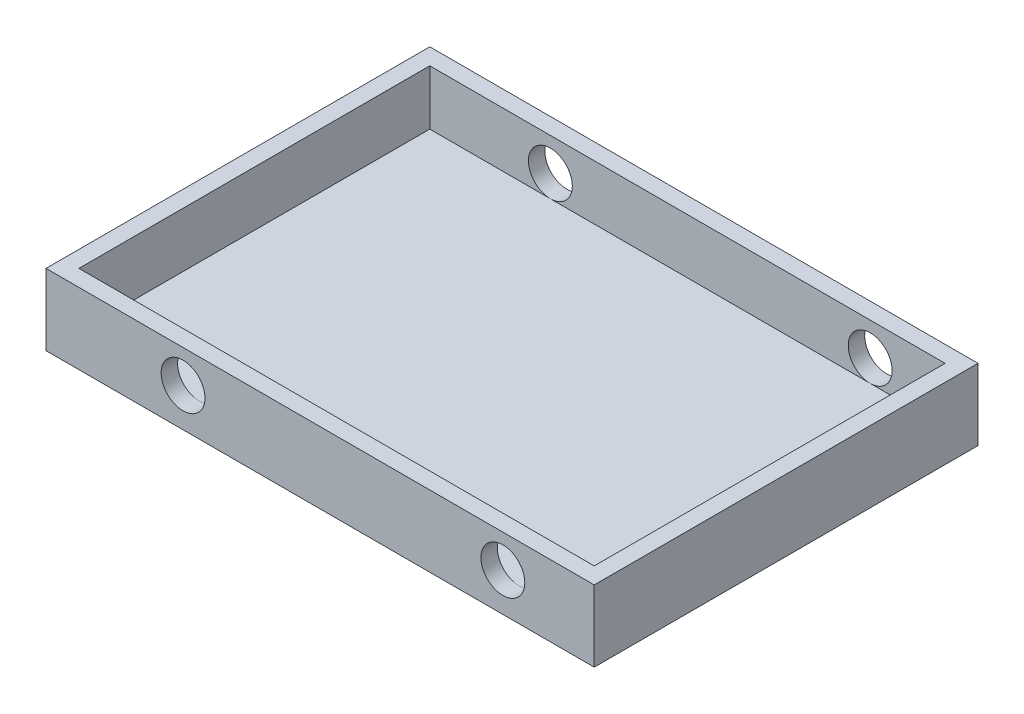
ISO-10303-21;
HEADER;
FILE_DESCRIPTION(('STEP AP214'),'2;1');
FILE_NAME('part.step','',(''),(''),'','','');
FILE_SCHEMA(('AUTOMOTIVE_DESIGN { 1 0 10303 214 1 1 1 1 }'));
ENDSEC;
DATA;
#1=APPLICATION_CONTEXT('core data for automotive mechanical design processes');
#2=APPLICATION_PROTOCOL_DEFINITION('international standard','automotive_design',2000,#1);
#3=PRODUCT_CONTEXT('',#1,'mechanical');
#4=PRODUCT('Part','Part','',(#3));
#5=PRODUCT_RELATED_PRODUCT_CATEGORY('part','',(#4));
#6=PRODUCT_DEFINITION_FORMATION('','',#4);
#7=PRODUCT_DEFINITION_CONTEXT('part definition',#1,'design');
#8=PRODUCT_DEFINITION('design','',#6,#7);
#9=PRODUCT_DEFINITION_SHAPE('','',#8);
#10=(LENGTH_UNIT() NAMED_UNIT(*) SI_UNIT(.MILLI.,.METRE.));
#11=(NAMED_UNIT(*) PLANE_ANGLE_UNIT() SI_UNIT($,.RADIAN.));
#12=(NAMED_UNIT(*) SI_UNIT($,.STERADIAN.) SOLID_ANGLE_UNIT());
#13=UNCERTAINTY_MEASURE_WITH_UNIT(LENGTH_MEASURE(1.E-05),#10,'distance_accuracy_value','');
#14=(GEOMETRIC_REPRESENTATION_CONTEXT(3) GLOBAL_UNCERTAINTY_ASSIGNED_CONTEXT((#13)) GLOBAL_UNIT_ASSIGNED_CONTEXT((#10,
#11,#12)) REPRESENTATION_CONTEXT('',''));
#15=CARTESIAN_POINT('',(0.,0.,0.));
#16=DIRECTION('',(0.,0.,1.));
#17=DIRECTION('',(1.,0.,0.));
#18=AXIS2_PLACEMENT_3D('',#15,#16,#17);
#19=CARTESIAN_POINT('',(250.,15.,-175.));
#20=DIRECTION('',(-1.,0.,0.));
#21=DIRECTION('',(0.,0.,1.));
#22=AXIS2_PLACEMENT_3D('',#19,#20,#21);
#23=PLANE('',#22);
#24=DIRECTION('',(0.,0.,-1.));
#25=VECTOR('',#24,1.);
#26=CARTESIAN_POINT('',(250.,0.,-175.));
#27=LINE('',#26,#25);
#28=CARTESIAN_POINT('',(250.,0.,175.));
#29=VERTEX_POINT('',#28);
#30=CARTESIAN_POINT('',(250.,0.,-175.));
#31=VERTEX_POINT('',#30);
#32=EDGE_CURVE('E177',#29,#31,#27,.T.);
#33=ORIENTED_EDGE('',*,*,#32,.T.);
#34=DIRECTION('',(0.,-1.,0.));
#35=VECTOR('',#34,1.);
#36=CARTESIAN_POINT('',(250.,15.,-175.));
#37=LINE('',#36,#35);
#38=CARTESIAN_POINT('',(250.,65.,-175.));
#39=VERTEX_POINT('',#38);
#40=EDGE_CURVE('E11',#39,#31,#37,.T.);
#41=ORIENTED_EDGE('',*,*,#40,.F.);
#42=DIRECTION('',(0.,0.,-1.));
#43=VECTOR('',#42,1.);
#44=CARTESIAN_POINT('',(250.,65.,-175.));
#45=LINE('',#44,#43);
#46=CARTESIAN_POINT('',(250.,65.,175.));
#47=VERTEX_POINT('',#46);
#48=EDGE_CURVE('E136',#47,#39,#45,.T.);
#49=ORIENTED_EDGE('',*,*,#48,.F.);
#50=DIRECTION('',(0.,-1.,0.));
#51=VECTOR('',#50,1.);
#52=CARTESIAN_POINT('',(250.,15.,175.));
#53=LINE('',#52,#51);
#54=EDGE_CURVE('E186',#47,#29,#53,.T.);
#55=ORIENTED_EDGE('',*,*,#54,.T.);
#56=EDGE_LOOP('',(#33,#41,#49,#55));
#57=FACE_BOUND('',#56,.T.);
#58=ADVANCED_FACE('F39',(#57),#23,.F.);
#59=CARTESIAN_POINT('',(-250.,15.,-175.));
#60=DIRECTION('',(0.,0.,1.));
#61=DIRECTION('',(1.,0.,0.));
#62=AXIS2_PLACEMENT_3D('',#59,#60,#61);
#63=PLANE('',#62);
#64=CARTESIAN_POINT('',(166.666666666667,35.,-175.));
#65=DIRECTION('',(0.,0.,1.));
#66=DIRECTION('',(1.,0.,0.));
#67=AXIS2_PLACEMENT_3D('',#64,#65,#66);
#68=CIRCLE('',#67,20.);
#69=CARTESIAN_POINT('',(186.666666666667,35.,-175.));
#70=VERTEX_POINT('',#69);
#71=EDGE_CURVE('E263',#70,#70,#68,.T.);
#72=ORIENTED_EDGE('',*,*,#71,.T.);
#73=EDGE_LOOP('',(#72));
#74=FACE_BOUND('',#73,.T.);
#75=CARTESIAN_POINT('',(-125.,35.,-175.));
#76=DIRECTION('',(0.,0.,1.));
#77=DIRECTION('',(1.,0.,0.));
#78=AXIS2_PLACEMENT_3D('',#75,#76,#77);
#79=CIRCLE('',#78,20.);
#80=CARTESIAN_POINT('',(-105.,35.,-175.));
#81=VERTEX_POINT('',#80);
#82=EDGE_CURVE('E268',#81,#81,#79,.T.);
#83=ORIENTED_EDGE('',*,*,#82,.T.);
#84=EDGE_LOOP('',(#83));
#85=FACE_BOUND('',#84,.T.);
#86=DIRECTION('',(-1.,0.,0.));
#87=VECTOR('',#86,1.);
#88=CARTESIAN_POINT('',(-250.,0.,-175.));
#89=LINE('',#88,#87);
#90=CARTESIAN_POINT('',(-250.,0.,-175.));
#91=VERTEX_POINT('',#90);
#92=EDGE_CURVE('E180',#31,#91,#89,.T.);
#93=ORIENTED_EDGE('',*,*,#92,.T.);
#94=DIRECTION('',(0.,-1.,0.));
#95=VECTOR('',#94,1.);
#96=CARTESIAN_POINT('',(-250.,15.,-175.));
#97=LINE('',#96,#95);
#98=CARTESIAN_POINT('',(-250.,65.,-175.));
#99=VERTEX_POINT('',#98);
#100=EDGE_CURVE('E46',#99,#91,#97,.T.);
#101=ORIENTED_EDGE('',*,*,#100,.F.);
#102=DIRECTION('',(-1.,0.,0.));
#103=VECTOR('',#102,1.);
#104=CARTESIAN_POINT('',(-250.,65.,-175.));
#105=LINE('',#104,#103);
#106=EDGE_CURVE('E168',#39,#99,#105,.T.);
#107=ORIENTED_EDGE('',*,*,#106,.F.);
#108=ORIENTED_EDGE('',*,*,#40,.T.);
#109=EDGE_LOOP('',(#93,#101,#107,#108));
#110=FACE_BOUND('',#109,.T.);
#111=ADVANCED_FACE('F208',(#74,#85,#110),#63,.F.);
#112=CARTESIAN_POINT('',(-250.,15.,-175.));
#113=DIRECTION('',(1.,0.,0.));
#114=DIRECTION('',(0.,0.,-1.));
#115=AXIS2_PLACEMENT_3D('',#112,#113,#114);
#116=PLANE('',#115);
#117=DIRECTION('',(0.,0.,1.));
#118=VECTOR('',#117,1.);
#119=CARTESIAN_POINT('',(-250.,0.,-175.));
#120=LINE('',#119,#118);
#121=CARTESIAN_POINT('',(-250.,0.,175.));
#122=VERTEX_POINT('',#121);
#123=EDGE_CURVE('E182',#91,#122,#120,.T.);
#124=ORIENTED_EDGE('',*,*,#123,.T.);
#125=DIRECTION('',(0.,-1.,0.));
#126=VECTOR('',#125,1.);
#127=CARTESIAN_POINT('',(-250.,15.,175.));
#128=LINE('',#127,#126);
#129=CARTESIAN_POINT('',(-250.,65.,175.));
#130=VERTEX_POINT('',#129);
#131=EDGE_CURVE('E189',#130,#122,#128,.T.);
#132=ORIENTED_EDGE('',*,*,#131,.F.);
#133=DIRECTION('',(0.,0.,1.));
#134=VECTOR('',#133,1.);
#135=CARTESIAN_POINT('',(-250.,65.,-175.));
#136=LINE('',#135,#134);
#137=EDGE_CURVE('E171',#99,#130,#136,.T.);
#138=ORIENTED_EDGE('',*,*,#137,.F.);
#139=ORIENTED_EDGE('',*,*,#100,.T.);
#140=EDGE_LOOP('',(#124,#132,#138,#139));
#141=FACE_BOUND('',#140,.T.);
#142=ADVANCED_FACE('F195',(#141),#116,.F.);
#143=CARTESIAN_POINT('',(-250.,15.,175.));
#144=DIRECTION('',(0.,0.,-1.));
#145=DIRECTION('',(-1.,0.,0.));
#146=AXIS2_PLACEMENT_3D('',#143,#144,#145);
#147=PLANE('',#146);
#148=CARTESIAN_POINT('',(166.666666666667,35.,175.));
#149=DIRECTION('',(0.,0.,1.));
#150=DIRECTION('',(1.,0.,0.));
#151=AXIS2_PLACEMENT_3D('',#148,#149,#150);
#152=CIRCLE('',#151,20.);
#153=CARTESIAN_POINT('',(186.666666666667,35.,175.));
#154=VERTEX_POINT('',#153);
#155=EDGE_CURVE('E262',#154,#154,#152,.T.);
#156=ORIENTED_EDGE('',*,*,#155,.F.);
#157=EDGE_LOOP('',(#156));
#158=FACE_BOUND('',#157,.T.);
#159=CARTESIAN_POINT('',(-125.,35.,175.));
#160=DIRECTION('',(0.,0.,1.));
#161=DIRECTION('',(1.,0.,0.));
#162=AXIS2_PLACEMENT_3D('',#159,#160,#161);
#163=CIRCLE('',#162,20.);
#164=CARTESIAN_POINT('',(-105.,35.,175.));
#165=VERTEX_POINT('',#164);
#166=EDGE_CURVE('E264',#165,#165,#163,.T.);
#167=ORIENTED_EDGE('',*,*,#166,.F.);
#168=EDGE_LOOP('',(#167));
#169=FACE_BOUND('',#168,.T.);
#170=DIRECTION('',(1.,0.,0.));
#171=VECTOR('',#170,1.);
#172=CARTESIAN_POINT('',(-250.,0.,175.));
#173=LINE('',#172,#171);
#174=EDGE_CURVE('E184',#122,#29,#173,.T.);
#175=ORIENTED_EDGE('',*,*,#174,.T.);
#176=ORIENTED_EDGE('',*,*,#54,.F.);
#177=DIRECTION('',(1.,0.,0.));
#178=VECTOR('',#177,1.);
#179=CARTESIAN_POINT('',(-250.,65.,175.));
#180=LINE('',#179,#178);
#181=EDGE_CURVE('E174',#130,#47,#180,.T.);
#182=ORIENTED_EDGE('',*,*,#181,.F.);
#183=ORIENTED_EDGE('',*,*,#131,.T.);
#184=EDGE_LOOP('',(#175,#176,#182,#183));
#185=FACE_BOUND('',#184,.T.);
#186=ADVANCED_FACE('F203',(#158,#169,#185),#147,.F.);
#187=CARTESIAN_POINT('',(0.,0.,0.));
#188=DIRECTION('',(0.,1.,0.));
#189=DIRECTION('',(0.,0.,1.));
#190=AXIS2_PLACEMENT_3D('',#187,#188,#189);
#191=PLANE('',#190);
#192=ORIENTED_EDGE('',*,*,#32,.F.);
#193=ORIENTED_EDGE('',*,*,#174,.F.);
#194=ORIENTED_EDGE('',*,*,#123,.F.);
#195=ORIENTED_EDGE('',*,*,#92,.F.);
#196=EDGE_LOOP('',(#192,#193,#194,#195));
#197=FACE_BOUND('',#196,.T.);
#198=ADVANCED_FACE('F201',(#197),#191,.F.);
#199=CARTESIAN_POINT('',(0.,65.,0.));
#200=DIRECTION('',(0.,1.,0.));
#201=DIRECTION('',(0.,0.,1.));
#202=AXIS2_PLACEMENT_3D('',#199,#200,#201);
#203=PLANE('',#202);
#204=ORIENTED_EDGE('',*,*,#48,.T.);
#205=ORIENTED_EDGE('',*,*,#106,.T.);
#206=ORIENTED_EDGE('',*,*,#137,.T.);
#207=ORIENTED_EDGE('',*,*,#181,.T.);
#208=EDGE_LOOP('',(#204,#205,#206,#207));
#209=FACE_BOUND('',#208,.T.);
#210=DIRECTION('',(1.,0.,0.));
#211=VECTOR('',#210,1.);
#212=CARTESIAN_POINT('',(235.,65.,160.));
#213=LINE('',#212,#211);
#214=CARTESIAN_POINT('',(-235.,65.,160.));
#215=VERTEX_POINT('',#214);
#216=CARTESIAN_POINT('',(235.,65.,160.));
#217=VERTEX_POINT('',#216);
#218=EDGE_CURVE('E124',#215,#217,#213,.T.);
#219=ORIENTED_EDGE('',*,*,#218,.F.);
#220=DIRECTION('',(0.,0.,1.));
#221=VECTOR('',#220,1.);
#222=CARTESIAN_POINT('',(-235.,65.,160.));
#223=LINE('',#222,#221);
#224=CARTESIAN_POINT('',(-235.,65.,-160.));
#225=VERTEX_POINT('',#224);
#226=EDGE_CURVE('E114',#225,#215,#223,.T.);
#227=ORIENTED_EDGE('',*,*,#226,.F.);
#228=DIRECTION('',(-1.,0.,0.));
#229=VECTOR('',#228,1.);
#230=CARTESIAN_POINT('',(-235.,65.,-160.));
#231=LINE('',#230,#229);
#232=CARTESIAN_POINT('',(235.,65.,-160.));
#233=VERTEX_POINT('',#232);
#234=EDGE_CURVE('E144',#233,#225,#231,.T.);
#235=ORIENTED_EDGE('',*,*,#234,.F.);
#236=DIRECTION('',(0.,0.,-1.));
#237=VECTOR('',#236,1.);
#238=CARTESIAN_POINT('',(235.,65.,-160.));
#239=LINE('',#238,#237);
#240=EDGE_CURVE('E142',#217,#233,#239,.T.);
#241=ORIENTED_EDGE('',*,*,#240,.F.);
#242=EDGE_LOOP('',(#219,#227,#235,#241));
#243=FACE_BOUND('',#242,.T.);
#244=ADVANCED_FACE('F140',(#209,#243),#203,.T.);
#245=CARTESIAN_POINT('',(-235.,65.,160.));
#246=DIRECTION('',(1.,0.,0.));
#247=DIRECTION('',(0.,0.,-1.));
#248=AXIS2_PLACEMENT_3D('',#245,#246,#247);
#249=PLANE('',#248);
#250=DIRECTION('',(0.,0.,1.));
#251=VECTOR('',#250,1.);
#252=CARTESIAN_POINT('',(-235.,15.,160.));
#253=LINE('',#252,#251);
#254=CARTESIAN_POINT('',(-235.,15.,-160.));
#255=VERTEX_POINT('',#254);
#256=CARTESIAN_POINT('',(-235.,15.,160.));
#257=VERTEX_POINT('',#256);
#258=EDGE_CURVE('E149',#255,#257,#253,.T.);
#259=ORIENTED_EDGE('',*,*,#258,.F.);
#260=DIRECTION('',(0.,-1.,0.));
#261=VECTOR('',#260,1.);
#262=CARTESIAN_POINT('',(-235.,65.,-160.));
#263=LINE('',#262,#261);
#264=EDGE_CURVE('E120',#225,#255,#263,.T.);
#265=ORIENTED_EDGE('',*,*,#264,.F.);
#266=ORIENTED_EDGE('',*,*,#226,.T.);
#267=DIRECTION('',(0.,-1.,0.));
#268=VECTOR('',#267,1.);
#269=CARTESIAN_POINT('',(-235.,65.,160.));
#270=LINE('',#269,#268);
#271=EDGE_CURVE('E118',#215,#257,#270,.T.);
#272=ORIENTED_EDGE('',*,*,#271,.T.);
#273=EDGE_LOOP('',(#259,#265,#266,#272));
#274=FACE_BOUND('',#273,.T.);
#275=ADVANCED_FACE('F117',(#274),#249,.T.);
#276=CARTESIAN_POINT('',(235.,65.,160.));
#277=DIRECTION('',(0.,0.,-1.));
#278=DIRECTION('',(-1.,0.,0.));
#279=AXIS2_PLACEMENT_3D('',#276,#277,#278);
#280=PLANE('',#279);
#281=DIRECTION('',(1.,0.,0.));
#282=VECTOR('',#281,1.);
#283=CARTESIAN_POINT('',(235.,15.,160.));
#284=LINE('',#283,#282);
#285=CARTESIAN_POINT('',(166.666666666667,15.,160.));
#286=VERTEX_POINT('',#285);
#287=CARTESIAN_POINT('',(235.,15.,160.));
#288=VERTEX_POINT('',#287);
#289=EDGE_CURVE('E151',#286,#288,#284,.T.);
#290=ORIENTED_EDGE('',*,*,#289,.F.);
#291=CARTESIAN_POINT('',(166.666666666667,35.,160.));
#292=DIRECTION('',(0.,0.,-1.));
#293=DIRECTION('',(-1.,0.,0.));
#294=AXIS2_PLACEMENT_3D('',#291,#292,#293);
#295=CIRCLE('',#294,20.);
#296=EDGE_CURVE('E152',#286,#286,#295,.T.);
#297=ORIENTED_EDGE('',*,*,#296,.F.);
#298=CARTESIAN_POINT('',(-125.,15.,160.));
#299=VERTEX_POINT('',#298);
#300=EDGE_CURVE('E155',#299,#286,#284,.T.);
#301=ORIENTED_EDGE('',*,*,#300,.F.);
#302=CARTESIAN_POINT('',(-125.,35.,160.));
#303=DIRECTION('',(0.,0.,-1.));
#304=DIRECTION('',(-1.,0.,0.));
#305=AXIS2_PLACEMENT_3D('',#302,#303,#304);
#306=CIRCLE('',#305,20.);
#307=EDGE_CURVE('E274',#299,#299,#306,.T.);
#308=ORIENTED_EDGE('',*,*,#307,.F.);
#309=EDGE_CURVE('E135',#257,#299,#284,.T.);
#310=ORIENTED_EDGE('',*,*,#309,.F.);
#311=ORIENTED_EDGE('',*,*,#271,.F.);
#312=ORIENTED_EDGE('',*,*,#218,.T.);
#313=DIRECTION('',(0.,-1.,0.));
#314=VECTOR('',#313,1.);
#315=CARTESIAN_POINT('',(235.,65.,160.));
#316=LINE('',#315,#314);
#317=EDGE_CURVE('E137',#217,#288,#316,.T.);
#318=ORIENTED_EDGE('',*,*,#317,.T.);
#319=EDGE_LOOP('',(#290,#297,#301,#308,#310,#311,#312,#318));
#320=FACE_BOUND('',#319,.T.);
#321=ADVANCED_FACE('F130',(#320),#280,.T.);
#322=CARTESIAN_POINT('',(235.,65.,-160.));
#323=DIRECTION('',(-1.,0.,0.));
#324=DIRECTION('',(0.,0.,1.));
#325=AXIS2_PLACEMENT_3D('',#322,#323,#324);
#326=PLANE('',#325);
#327=DIRECTION('',(0.,0.,-1.));
#328=VECTOR('',#327,1.);
#329=CARTESIAN_POINT('',(235.,15.,-160.));
#330=LINE('',#329,#328);
#331=CARTESIAN_POINT('',(235.,15.,-160.));
#332=VERTEX_POINT('',#331);
#333=EDGE_CURVE('E154',#288,#332,#330,.T.);
#334=ORIENTED_EDGE('',*,*,#333,.F.);
#335=ORIENTED_EDGE('',*,*,#317,.F.);
#336=ORIENTED_EDGE('',*,*,#240,.T.);
#337=DIRECTION('',(0.,-1.,0.));
#338=VECTOR('',#337,1.);
#339=CARTESIAN_POINT('',(235.,65.,-160.));
#340=LINE('',#339,#338);
#341=EDGE_CURVE('E162',#233,#332,#340,.T.);
#342=ORIENTED_EDGE('',*,*,#341,.T.);
#343=EDGE_LOOP('',(#334,#335,#336,#342));
#344=FACE_BOUND('',#343,.T.);
#345=ADVANCED_FACE('F237',(#344),#326,.T.);
#346=CARTESIAN_POINT('',(-235.,65.,-160.));
#347=DIRECTION('',(0.,0.,1.));
#348=DIRECTION('',(1.,0.,0.));
#349=AXIS2_PLACEMENT_3D('',#346,#347,#348);
#350=PLANE('',#349);
#351=DIRECTION('',(-1.,0.,0.));
#352=VECTOR('',#351,1.);
#353=CARTESIAN_POINT('',(-235.,15.,-160.));
#354=LINE('',#353,#352);
#355=CARTESIAN_POINT('',(166.666666666667,15.,-160.));
#356=VERTEX_POINT('',#355);
#357=CARTESIAN_POINT('',(-125.,15.,-160.));
#358=VERTEX_POINT('',#357);
#359=EDGE_CURVE('E160',#356,#358,#354,.T.);
#360=ORIENTED_EDGE('',*,*,#359,.F.);
#361=CARTESIAN_POINT('',(166.666666666667,35.,-160.));
#362=DIRECTION('',(0.,0.,1.));
#363=DIRECTION('',(1.,0.,0.));
#364=AXIS2_PLACEMENT_3D('',#361,#362,#363);
#365=CIRCLE('',#364,20.);
#366=EDGE_CURVE('E56',#356,#356,#365,.T.);
#367=ORIENTED_EDGE('',*,*,#366,.F.);
#368=EDGE_CURVE('E125',#332,#356,#354,.T.);
#369=ORIENTED_EDGE('',*,*,#368,.F.);
#370=ORIENTED_EDGE('',*,*,#341,.F.);
#371=ORIENTED_EDGE('',*,*,#234,.T.);
#372=ORIENTED_EDGE('',*,*,#264,.T.);
#373=EDGE_CURVE('E157',#358,#255,#354,.T.);
#374=ORIENTED_EDGE('',*,*,#373,.F.);
#375=CARTESIAN_POINT('',(-125.,35.,-160.));
#376=DIRECTION('',(0.,0.,1.));
#377=DIRECTION('',(1.,0.,0.));
#378=AXIS2_PLACEMENT_3D('',#375,#376,#377);
#379=CIRCLE('',#378,20.);
#380=EDGE_CURVE('E51',#358,#358,#379,.T.);
#381=ORIENTED_EDGE('',*,*,#380,.F.);
#382=EDGE_LOOP('',(#360,#367,#369,#370,#371,#372,#374,#381));
#383=FACE_BOUND('',#382,.T.);
#384=ADVANCED_FACE('F229',(#383),#350,.T.);
#385=CARTESIAN_POINT('',(0.,15.,0.));
#386=DIRECTION('',(0.,1.,0.));
#387=DIRECTION('',(0.,0.,1.));
#388=AXIS2_PLACEMENT_3D('',#385,#386,#387);
#389=PLANE('',#388);
#390=ORIENTED_EDGE('',*,*,#309,.T.);
#391=ORIENTED_EDGE('',*,*,#300,.T.);
#392=ORIENTED_EDGE('',*,*,#289,.T.);
#393=ORIENTED_EDGE('',*,*,#333,.T.);
#394=ORIENTED_EDGE('',*,*,#368,.T.);
#395=ORIENTED_EDGE('',*,*,#359,.T.);
#396=ORIENTED_EDGE('',*,*,#373,.T.);
#397=ORIENTED_EDGE('',*,*,#258,.T.);
#398=EDGE_LOOP('',(#390,#391,#392,#393,#394,#395,#396,#397));
#399=FACE_BOUND('',#398,.T.);
#400=ADVANCED_FACE('F225',(#399),#389,.T.);
#401=CARTESIAN_POINT('',(-125.,35.,-175.));
#402=DIRECTION('',(0.,0.,1.));
#403=DIRECTION('',(1.,0.,0.));
#404=AXIS2_PLACEMENT_3D('',#401,#402,#403);
#405=CYLINDRICAL_SURFACE('',#404,20.);
#406=ORIENTED_EDGE('',*,*,#380,.T.);
#407=EDGE_LOOP('',(#406));
#408=FACE_BOUND('',#407,.T.);
#409=ORIENTED_EDGE('',*,*,#82,.F.);
#410=EDGE_LOOP('',(#409));
#411=FACE_BOUND('',#410,.T.);
#412=ADVANCED_FACE('F228',(#408,#411),#405,.F.);
#413=CARTESIAN_POINT('',(166.666666666667,35.,-175.));
#414=DIRECTION('',(0.,0.,1.));
#415=DIRECTION('',(1.,0.,0.));
#416=AXIS2_PLACEMENT_3D('',#413,#414,#415);
#417=CYLINDRICAL_SURFACE('',#416,20.);
#418=ORIENTED_EDGE('',*,*,#366,.T.);
#419=EDGE_LOOP('',(#418));
#420=FACE_BOUND('',#419,.T.);
#421=ORIENTED_EDGE('',*,*,#71,.F.);
#422=EDGE_LOOP('',(#421));
#423=FACE_BOUND('',#422,.T.);
#424=ADVANCED_FACE('F245',(#420,#423),#417,.F.);
#425=ORIENTED_EDGE('',*,*,#307,.T.);
#426=EDGE_LOOP('',(#425));
#427=FACE_BOUND('',#426,.T.);
#428=ORIENTED_EDGE('',*,*,#166,.T.);
#429=EDGE_LOOP('',(#428));
#430=FACE_BOUND('',#429,.T.);
#431=ADVANCED_FACE('F246',(#427,#430),#405,.F.);
#432=ORIENTED_EDGE('',*,*,#296,.T.);
#433=EDGE_LOOP('',(#432));
#434=FACE_BOUND('',#433,.T.);
#435=ORIENTED_EDGE('',*,*,#155,.T.);
#436=EDGE_LOOP('',(#435));
#437=FACE_BOUND('',#436,.T.);
#438=ADVANCED_FACE('F248',(#434,#437),#417,.F.);
#439=CLOSED_SHELL('',(#58,#111,#142,#186,#198,#244,#275,#321,#345,#384,#400,#412,#424,#431,#438));
#440=MANIFOLD_SOLID_BREP('B2',#439);
#441=ADVANCED_BREP_SHAPE_REPRESENTATION('',(#18,#440),#14);
#442=SHAPE_DEFINITION_REPRESENTATION(#9,#441);
ENDSEC;
END-ISO-10303-21;
